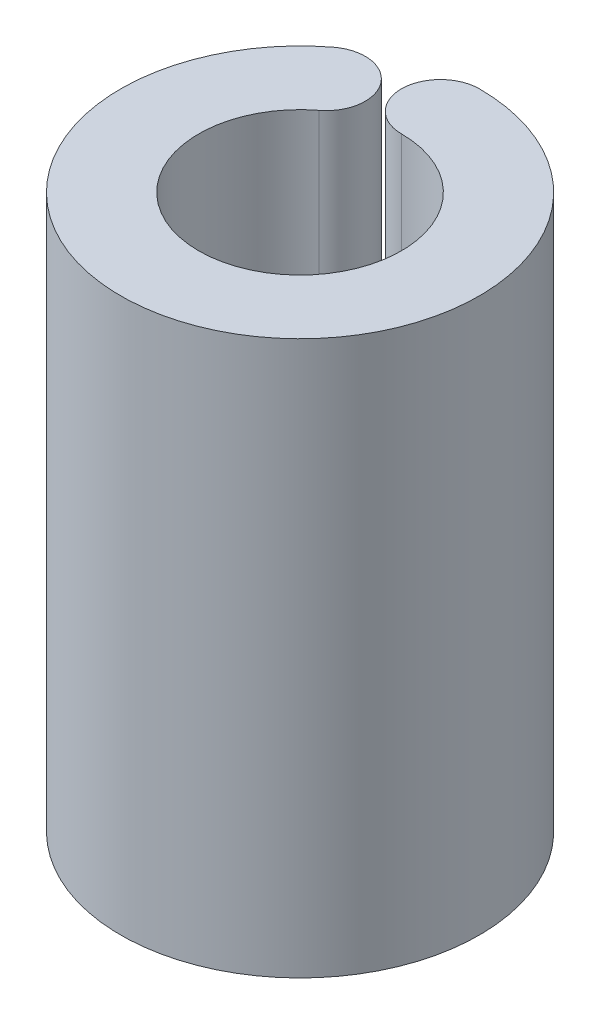
ISO-10303-21;
HEADER;
FILE_DESCRIPTION(('STEP AP214'),'2;1');
FILE_NAME('part.step','',(''),(''),'','','');
FILE_SCHEMA(('AUTOMOTIVE_DESIGN { 1 0 10303 214 1 1 1 1 }'));
ENDSEC;
DATA;
#1=APPLICATION_CONTEXT('core data for automotive mechanical design processes');
#2=APPLICATION_PROTOCOL_DEFINITION('international standard','automotive_design',2000,#1);
#3=PRODUCT_CONTEXT('',#1,'mechanical');
#4=PRODUCT('Part','Part','',(#3));
#5=PRODUCT_RELATED_PRODUCT_CATEGORY('part','',(#4));
#6=PRODUCT_DEFINITION_FORMATION('','',#4);
#7=PRODUCT_DEFINITION_CONTEXT('part definition',#1,'design');
#8=PRODUCT_DEFINITION('design','',#6,#7);
#9=PRODUCT_DEFINITION_SHAPE('','',#8);
#10=(LENGTH_UNIT() NAMED_UNIT(*) SI_UNIT(.MILLI.,.METRE.));
#11=(NAMED_UNIT(*) PLANE_ANGLE_UNIT() SI_UNIT($,.RADIAN.));
#12=(NAMED_UNIT(*) SI_UNIT($,.STERADIAN.) SOLID_ANGLE_UNIT());
#13=UNCERTAINTY_MEASURE_WITH_UNIT(LENGTH_MEASURE(1.E-05),#10,'distance_accuracy_value','');
#14=(GEOMETRIC_REPRESENTATION_CONTEXT(3) GLOBAL_UNCERTAINTY_ASSIGNED_CONTEXT((#13)) GLOBAL_UNIT_ASSIGNED_CONTEXT((#10,
#11,#12)) REPRESENTATION_CONTEXT('',''));
#15=CARTESIAN_POINT('',(0.,0.,0.));
#16=DIRECTION('',(0.,0.,1.));
#17=DIRECTION('',(1.,0.,0.));
#18=AXIS2_PLACEMENT_3D('',#15,#16,#17);
#19=CARTESIAN_POINT('',(0.,14.2,0.));
#20=DIRECTION('',(0.,-1.,0.));
#21=DIRECTION('',(0.,0.,-1.));
#22=AXIS2_PLACEMENT_3D('',#19,#20,#21);
#23=CYLINDRICAL_SURFACE('',#22,2.6);
#24=CARTESIAN_POINT('',(0.,0.,0.));
#25=DIRECTION('',(0.,1.,0.));
#26=DIRECTION('',(0.,0.,1.));
#27=AXIS2_PLACEMENT_3D('',#24,#25,#26);
#28=CIRCLE('',#27,2.6);
#29=CARTESIAN_POINT('',(0.,0.,-2.6));
#30=VERTEX_POINT('',#29);
#31=CARTESIAN_POINT('',(-1.57975097216721,0.,-2.06503919234884));
#32=VERTEX_POINT('',#31);
#33=EDGE_CURVE('E106',#30,#32,#28,.F.);
#34=ORIENTED_EDGE('',*,*,#33,.T.);
#35=DIRECTION('',(0.,-1.,0.));
#36=VECTOR('',#35,1.);
#37=CARTESIAN_POINT('',(-1.57975097216721,14.2,-2.06503919234884));
#38=LINE('',#37,#36);
#39=CARTESIAN_POINT('',(-1.57975097216721,14.2,-2.06503919234884));
#40=VERTEX_POINT('',#39);
#41=EDGE_CURVE('E11',#40,#32,#38,.T.);
#42=ORIENTED_EDGE('',*,*,#41,.F.);
#43=CARTESIAN_POINT('',(0.,14.2,0.));
#44=DIRECTION('',(0.,1.,0.));
#45=DIRECTION('',(0.,0.,1.));
#46=AXIS2_PLACEMENT_3D('',#43,#44,#45);
#47=CIRCLE('',#46,2.6);
#48=CARTESIAN_POINT('',(0.,14.2,-2.6));
#49=VERTEX_POINT('',#48);
#50=EDGE_CURVE('E89',#49,#40,#47,.F.);
#51=ORIENTED_EDGE('',*,*,#50,.F.);
#52=DIRECTION('',(0.,-1.,0.));
#53=VECTOR('',#52,1.);
#54=CARTESIAN_POINT('',(0.,14.2,-2.6));
#55=LINE('',#54,#53);
#56=EDGE_CURVE('E56',#49,#30,#55,.T.);
#57=ORIENTED_EDGE('',*,*,#56,.T.);
#58=EDGE_LOOP('',(#34,#42,#51,#57));
#59=FACE_BOUND('',#58,.T.);
#60=ADVANCED_FACE('F39',(#59),#23,.F.);
#61=CARTESIAN_POINT('',(-2.18734749992382,14.2,-2.85928503555994));
#62=DIRECTION('',(0.,-1.,0.));
#63=DIRECTION('',(0.,0.,-1.));
#64=AXIS2_PLACEMENT_3D('',#61,#62,#63);
#65=CYLINDRICAL_SURFACE('',#64,1.);
#66=CARTESIAN_POINT('',(-2.18734749992382,0.,-2.85928503555994));
#67=DIRECTION('',(0.,1.,0.));
#68=DIRECTION('',(0.,0.,1.));
#69=AXIS2_PLACEMENT_3D('',#66,#67,#68);
#70=CIRCLE('',#69,1.);
#71=CARTESIAN_POINT('',(-2.79494402768044,0.,-3.65353087877103));
#72=VERTEX_POINT('',#71);
#73=EDGE_CURVE('E94',#32,#72,#70,.T.);
#74=ORIENTED_EDGE('',*,*,#73,.T.);
#75=DIRECTION('',(0.,-1.,0.));
#76=VECTOR('',#75,1.);
#77=CARTESIAN_POINT('',(-2.79494402768044,14.2,-3.65353087877103));
#78=LINE('',#77,#76);
#79=CARTESIAN_POINT('',(-2.79494402768044,14.2,-3.65353087877103));
#80=VERTEX_POINT('',#79);
#81=EDGE_CURVE('E48',#80,#72,#78,.T.);
#82=ORIENTED_EDGE('',*,*,#81,.F.);
#83=CARTESIAN_POINT('',(-2.18734749992382,14.2,-2.85928503555994));
#84=DIRECTION('',(0.,1.,0.));
#85=DIRECTION('',(0.,0.,1.));
#86=AXIS2_PLACEMENT_3D('',#83,#84,#85);
#87=CIRCLE('',#86,1.);
#88=EDGE_CURVE('E81',#40,#80,#87,.T.);
#89=ORIENTED_EDGE('',*,*,#88,.F.);
#90=ORIENTED_EDGE('',*,*,#41,.T.);
#91=EDGE_LOOP('',(#74,#82,#89,#90));
#92=FACE_BOUND('',#91,.T.);
#93=ADVANCED_FACE('F93',(#92),#65,.T.);
#94=CARTESIAN_POINT('',(0.,14.2,0.));
#95=DIRECTION('',(0.,-1.,0.));
#96=DIRECTION('',(0.,0.,-1.));
#97=AXIS2_PLACEMENT_3D('',#94,#95,#96);
#98=CYLINDRICAL_SURFACE('',#97,4.6);
#99=CARTESIAN_POINT('',(0.,0.,0.));
#100=DIRECTION('',(0.,1.,0.));
#101=DIRECTION('',(0.,0.,1.));
#102=AXIS2_PLACEMENT_3D('',#99,#100,#101);
#103=CIRCLE('',#102,4.6);
#104=CARTESIAN_POINT('',(0.,0.,-4.6));
#105=VERTEX_POINT('',#104);
#106=EDGE_CURVE('E109',#105,#72,#103,.F.);
#107=ORIENTED_EDGE('',*,*,#106,.F.);
#108=DIRECTION('',(0.,-1.,0.));
#109=VECTOR('',#108,1.);
#110=CARTESIAN_POINT('',(0.,14.2,-4.6));
#111=LINE('',#110,#109);
#112=CARTESIAN_POINT('',(0.,14.2,-4.6));
#113=VERTEX_POINT('',#112);
#114=EDGE_CURVE('E70',#113,#105,#111,.T.);
#115=ORIENTED_EDGE('',*,*,#114,.F.);
#116=CARTESIAN_POINT('',(0.,14.2,0.));
#117=DIRECTION('',(0.,1.,0.));
#118=DIRECTION('',(0.,0.,1.));
#119=AXIS2_PLACEMENT_3D('',#116,#117,#118);
#120=CIRCLE('',#119,4.6);
#121=EDGE_CURVE('E88',#113,#80,#120,.F.);
#122=ORIENTED_EDGE('',*,*,#121,.T.);
#123=ORIENTED_EDGE('',*,*,#81,.T.);
#124=EDGE_LOOP('',(#107,#115,#122,#123));
#125=FACE_BOUND('',#124,.T.);
#126=ADVANCED_FACE('F98',(#125),#98,.T.);
#127=CARTESIAN_POINT('',(0.,14.2,-3.6));
#128=DIRECTION('',(0.,-1.,0.));
#129=DIRECTION('',(0.,0.,-1.));
#130=AXIS2_PLACEMENT_3D('',#127,#128,#129);
#131=CYLINDRICAL_SURFACE('',#130,1.);
#132=CARTESIAN_POINT('',(0.,0.,-3.6));
#133=DIRECTION('',(0.,1.,0.));
#134=DIRECTION('',(0.,0.,1.));
#135=AXIS2_PLACEMENT_3D('',#132,#133,#134);
#136=CIRCLE('',#135,1.);
#137=EDGE_CURVE('E111',#30,#105,#136,.F.);
#138=ORIENTED_EDGE('',*,*,#137,.F.);
#139=ORIENTED_EDGE('',*,*,#56,.F.);
#140=CARTESIAN_POINT('',(0.,14.2,-3.6));
#141=DIRECTION('',(0.,1.,0.));
#142=DIRECTION('',(0.,0.,1.));
#143=AXIS2_PLACEMENT_3D('',#140,#141,#142);
#144=CIRCLE('',#143,1.);
#145=EDGE_CURVE('E100',#49,#113,#144,.F.);
#146=ORIENTED_EDGE('',*,*,#145,.T.);
#147=ORIENTED_EDGE('',*,*,#114,.T.);
#148=EDGE_LOOP('',(#138,#139,#146,#147));
#149=FACE_BOUND('',#148,.T.);
#150=ADVANCED_FACE('F119',(#149),#131,.T.);
#151=CARTESIAN_POINT('',(0.,14.2,0.));
#152=DIRECTION('',(0.,1.,0.));
#153=DIRECTION('',(0.,0.,1.));
#154=AXIS2_PLACEMENT_3D('',#151,#152,#153);
#155=PLANE('',#154);
#156=ORIENTED_EDGE('',*,*,#50,.T.);
#157=ORIENTED_EDGE('',*,*,#88,.T.);
#158=ORIENTED_EDGE('',*,*,#121,.F.);
#159=ORIENTED_EDGE('',*,*,#145,.F.);
#160=EDGE_LOOP('',(#156,#157,#158,#159));
#161=FACE_BOUND('',#160,.T.);
#162=ADVANCED_FACE('F85',(#161),#155,.T.);
#163=CARTESIAN_POINT('',(0.,0.,0.));
#164=DIRECTION('',(0.,1.,0.));
#165=DIRECTION('',(0.,0.,1.));
#166=AXIS2_PLACEMENT_3D('',#163,#164,#165);
#167=PLANE('',#166);
#168=ORIENTED_EDGE('',*,*,#33,.F.);
#169=ORIENTED_EDGE('',*,*,#137,.T.);
#170=ORIENTED_EDGE('',*,*,#106,.T.);
#171=ORIENTED_EDGE('',*,*,#73,.F.);
#172=EDGE_LOOP('',(#168,#169,#170,#171));
#173=FACE_BOUND('',#172,.T.);
#174=ADVANCED_FACE('F118',(#173),#167,.F.);
#175=CLOSED_SHELL('',(#60,#93,#126,#150,#162,#174));
#176=MANIFOLD_SOLID_BREP('B2',#175);
#177=ADVANCED_BREP_SHAPE_REPRESENTATION('',(#18,#176),#14);
#178=SHAPE_DEFINITION_REPRESENTATION(#9,#177);
ENDSEC;
END-ISO-10303-21;
